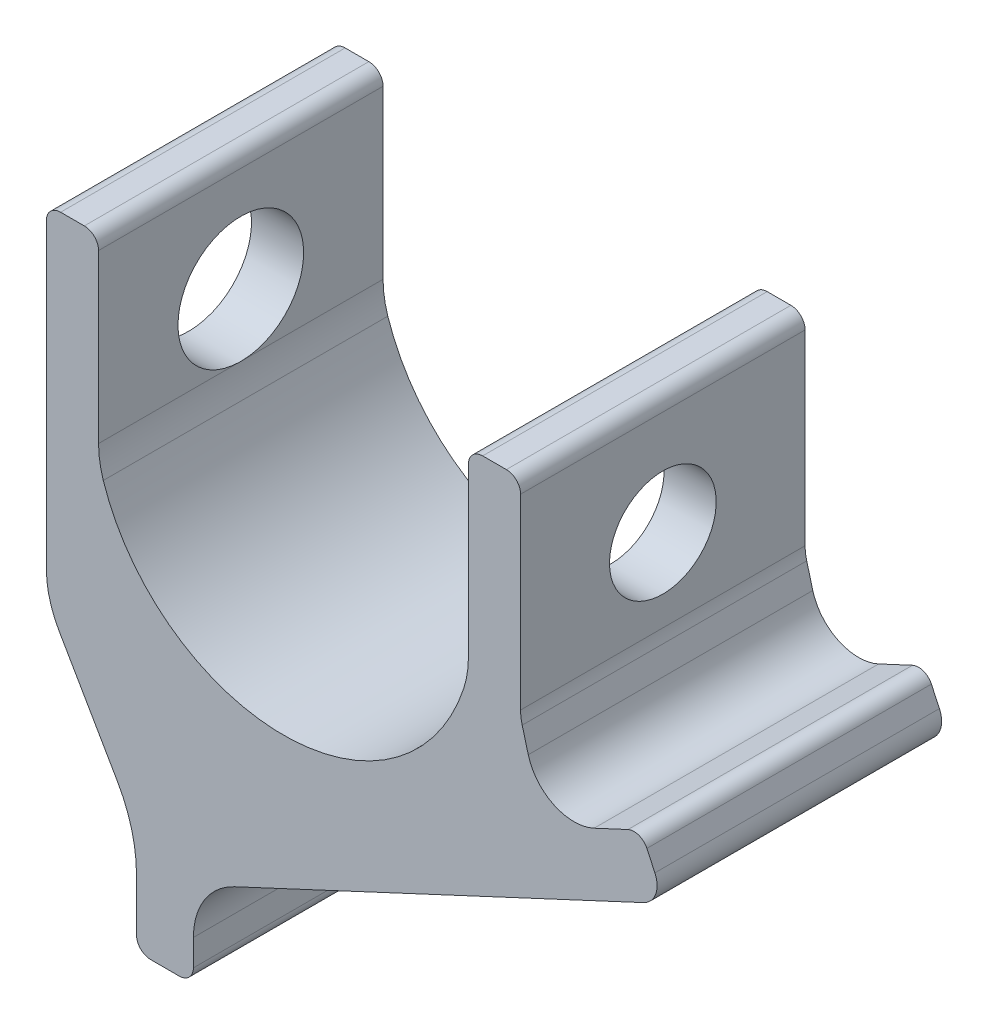
ISO-10303-21;
HEADER;
FILE_DESCRIPTION(('STEP AP214'),'2;1');
FILE_NAME('part.step','',(''),(''),'','','');
FILE_SCHEMA(('AUTOMOTIVE_DESIGN { 1 0 10303 214 1 1 1 1 }'));
ENDSEC;
DATA;
#1=APPLICATION_CONTEXT('core data for automotive mechanical design processes');
#2=APPLICATION_PROTOCOL_DEFINITION('international standard','automotive_design',2000,#1);
#3=PRODUCT_CONTEXT('',#1,'mechanical');
#4=PRODUCT('Part','Part','',(#3));
#5=PRODUCT_RELATED_PRODUCT_CATEGORY('part','',(#4));
#6=PRODUCT_DEFINITION_FORMATION('','',#4);
#7=PRODUCT_DEFINITION_CONTEXT('part definition',#1,'design');
#8=PRODUCT_DEFINITION('design','',#6,#7);
#9=PRODUCT_DEFINITION_SHAPE('','',#8);
#10=(LENGTH_UNIT() NAMED_UNIT(*) SI_UNIT(.MILLI.,.METRE.));
#11=(NAMED_UNIT(*) PLANE_ANGLE_UNIT() SI_UNIT($,.RADIAN.));
#12=(NAMED_UNIT(*) SI_UNIT($,.STERADIAN.) SOLID_ANGLE_UNIT());
#13=UNCERTAINTY_MEASURE_WITH_UNIT(LENGTH_MEASURE(1.E-05),#10,'distance_accuracy_value','');
#14=(GEOMETRIC_REPRESENTATION_CONTEXT(3) GLOBAL_UNCERTAINTY_ASSIGNED_CONTEXT((#13)) GLOBAL_UNIT_ASSIGNED_CONTEXT((#10,
#11,#12)) REPRESENTATION_CONTEXT('',''));
#15=CARTESIAN_POINT('',(0.,0.,0.));
#16=DIRECTION('',(0.,0.,1.));
#17=DIRECTION('',(1.,0.,0.));
#18=AXIS2_PLACEMENT_3D('',#15,#16,#17);
#19=CARTESIAN_POINT('',(-19.,-13.2449979983984,30.));
#20=DIRECTION('',(0.,0.,-1.));
#21=DIRECTION('',(-1.,0.,0.));
#22=AXIS2_PLACEMENT_3D('',#19,#20,#21);
#23=CYLINDRICAL_SURFACE('',#22,20.);
#24=CARTESIAN_POINT('',(-39.,0.,0.));
#25=DIRECTION('',(1.,0.,0.));
#26=DIRECTION('',(0.,-0.999622490445161,0.0274750176745001));
#27=AXIS2_PLACEMENT_3D('',#24,#25,#26);
#28=CIRCLE('',#27,13.25);
#29=CARTESIAN_POINT('',(-39.,-13.2449979983984,0.364043984187208));
#30=VERTEX_POINT('',#29);
#31=CARTESIAN_POINT('',(-39.,-13.2449979983984,-0.364043984187208));
#32=VERTEX_POINT('',#31);
#33=EDGE_CURVE('E56',#30,#32,#28,.T.);
#34=ORIENTED_EDGE('',*,*,#33,.F.);
#35=DIRECTION('',(0.,0.,-1.));
#36=VECTOR('',#35,1.);
#37=CARTESIAN_POINT('',(-39.,-13.2449979983984,30.));
#38=LINE('',#37,#36);
#39=CARTESIAN_POINT('',(-39.,-13.2449979983984,30.));
#40=VERTEX_POINT('',#39);
#41=EDGE_CURVE('E49',#40,#30,#38,.T.);
#42=ORIENTED_EDGE('',*,*,#41,.F.);
#43=CARTESIAN_POINT('',(-19.,-13.2449979983984,30.));
#44=DIRECTION('',(0.,0.,-1.));
#45=DIRECTION('',(-1.,0.,0.));
#46=AXIS2_PLACEMENT_3D('',#43,#44,#45);
#47=CIRCLE('',#46,20.);
#48=CARTESIAN_POINT('',(-38.,-19.4899959967968,30.));
#49=VERTEX_POINT('',#48);
#50=EDGE_CURVE('E254',#49,#40,#47,.T.);
#51=ORIENTED_EDGE('',*,*,#50,.F.);
#52=DIRECTION('',(0.,0.,-1.));
#53=VECTOR('',#52,1.);
#54=CARTESIAN_POINT('',(-38.,-19.4899959967968,30.));
#55=LINE('',#54,#53);
#56=CARTESIAN_POINT('',(-38.,-19.4899959967968,-30.));
#57=VERTEX_POINT('',#56);
#58=EDGE_CURVE('E11',#49,#57,#55,.T.);
#59=ORIENTED_EDGE('',*,*,#58,.T.);
#60=CARTESIAN_POINT('',(-19.,-13.2449979983984,-30.));
#61=DIRECTION('',(0.,0.,-1.));
#62=DIRECTION('',(-1.,0.,0.));
#63=AXIS2_PLACEMENT_3D('',#60,#61,#62);
#64=CIRCLE('',#63,20.);
#65=CARTESIAN_POINT('',(-39.,-13.2449979983984,-30.));
#66=VERTEX_POINT('',#65);
#67=EDGE_CURVE('E360',#57,#66,#64,.T.);
#68=ORIENTED_EDGE('',*,*,#67,.T.);
#69=EDGE_CURVE('E43',#32,#66,#38,.T.);
#70=ORIENTED_EDGE('',*,*,#69,.F.);
#71=EDGE_LOOP('',(#34,#42,#51,#59,#68,#70));
#72=FACE_BOUND('',#71,.T.);
#73=ADVANCED_FACE('F39',(#72),#23,.F.);
#74=CARTESIAN_POINT('',(-39.,-13.2449979983984,30.));
#75=DIRECTION('',(-1.,0.,0.));
#76=DIRECTION('',(0.,0.,1.));
#77=AXIS2_PLACEMENT_3D('',#74,#75,#76);
#78=PLANE('',#77);
#79=CARTESIAN_POINT('',(-39.,0.,0.));
#80=DIRECTION('',(-1.,0.,0.));
#81=DIRECTION('',(0.,0.,1.));
#82=AXIS2_PLACEMENT_3D('',#79,#80,#81);
#83=CIRCLE('',#82,13.25);
#84=EDGE_CURVE('E506',#32,#30,#83,.F.);
#85=ORIENTED_EDGE('',*,*,#84,.F.);
#86=ORIENTED_EDGE('',*,*,#69,.T.);
#87=DIRECTION('',(0.,1.,0.));
#88=VECTOR('',#87,1.);
#89=CARTESIAN_POINT('',(-39.,-13.2449979983984,-30.));
#90=LINE('',#89,#88);
#91=CARTESIAN_POINT('',(-39.,22.,-30.));
#92=VERTEX_POINT('',#91);
#93=EDGE_CURVE('E263',#66,#92,#90,.T.);
#94=ORIENTED_EDGE('',*,*,#93,.T.);
#95=DIRECTION('',(0.,0.,-1.));
#96=VECTOR('',#95,1.);
#97=CARTESIAN_POINT('',(-39.,22.,30.));
#98=LINE('',#97,#96);
#99=CARTESIAN_POINT('',(-39.,22.,30.));
#100=VERTEX_POINT('',#99);
#101=EDGE_CURVE('E260',#100,#92,#98,.T.);
#102=ORIENTED_EDGE('',*,*,#101,.F.);
#103=DIRECTION('',(0.,1.,0.));
#104=VECTOR('',#103,1.);
#105=CARTESIAN_POINT('',(-39.,-13.2449979983984,30.));
#106=LINE('',#105,#104);
#107=EDGE_CURVE('E249',#40,#100,#106,.T.);
#108=ORIENTED_EDGE('',*,*,#107,.F.);
#109=ORIENTED_EDGE('',*,*,#41,.T.);
#110=EDGE_LOOP('',(#85,#86,#94,#102,#108,#109));
#111=FACE_BOUND('',#110,.T.);
#112=ADVANCED_FACE('F261',(#111),#78,.F.);
#113=CARTESIAN_POINT('',(-50.,22.,30.));
#114=DIRECTION('',(1.,0.,0.));
#115=DIRECTION('',(0.,0.,-1.));
#116=AXIS2_PLACEMENT_3D('',#113,#114,#115);
#117=PLANE('',#116);
#118=DIRECTION('',(0.,-1.,0.));
#119=VECTOR('',#118,1.);
#120=CARTESIAN_POINT('',(-50.,22.,-30.));
#121=LINE('',#120,#119);
#122=CARTESIAN_POINT('',(-50.,22.,-30.));
#123=VERTEX_POINT('',#122);
#124=CARTESIAN_POINT('',(-50.,-41.6410161513775,-30.));
#125=VERTEX_POINT('',#124);
#126=EDGE_CURVE('E349',#123,#125,#121,.T.);
#127=ORIENTED_EDGE('',*,*,#126,.T.);
#128=DIRECTION('',(0.,0.,-1.));
#129=VECTOR('',#128,1.);
#130=CARTESIAN_POINT('',(-50.,-41.6410161513775,30.));
#131=LINE('',#130,#129);
#132=CARTESIAN_POINT('',(-50.,-41.6410161513775,30.));
#133=VERTEX_POINT('',#132);
#134=EDGE_CURVE('E584',#133,#125,#131,.T.);
#135=ORIENTED_EDGE('',*,*,#134,.F.);
#136=DIRECTION('',(0.,-1.,0.));
#137=VECTOR('',#136,1.);
#138=CARTESIAN_POINT('',(-50.,22.,30.));
#139=LINE('',#138,#137);
#140=CARTESIAN_POINT('',(-50.,22.,30.));
#141=VERTEX_POINT('',#140);
#142=EDGE_CURVE('E573',#141,#133,#139,.T.);
#143=ORIENTED_EDGE('',*,*,#142,.F.);
#144=DIRECTION('',(0.,0.,-1.));
#145=VECTOR('',#144,1.);
#146=CARTESIAN_POINT('',(-50.,22.,30.));
#147=LINE('',#146,#145);
#148=EDGE_CURVE('E579',#141,#123,#147,.T.);
#149=ORIENTED_EDGE('',*,*,#148,.T.);
#150=EDGE_LOOP('',(#127,#135,#143,#149));
#151=FACE_BOUND('',#150,.T.);
#152=CARTESIAN_POINT('',(-50.,0.,0.));
#153=DIRECTION('',(-1.,0.,0.));
#154=DIRECTION('',(0.,0.,1.));
#155=AXIS2_PLACEMENT_3D('',#152,#153,#154);
#156=CIRCLE('',#155,13.25);
#157=CARTESIAN_POINT('',(-50.,0.,13.25));
#158=VERTEX_POINT('',#157);
#159=EDGE_CURVE('E638',#158,#158,#156,.T.);
#160=ORIENTED_EDGE('',*,*,#159,.F.);
#161=EDGE_LOOP('',(#160));
#162=FACE_BOUND('',#161,.T.);
#163=ADVANCED_FACE('F385',(#151,#162),#117,.F.);
#164=CARTESIAN_POINT('',(50.,22.,30.));
#165=DIRECTION('',(1.,0.,0.));
#166=DIRECTION('',(0.,1.,0.));
#167=AXIS2_PLACEMENT_3D('',#164,#165,#166);
#168=PLANE('',#167);
#169=DIRECTION('',(0.,-1.,0.));
#170=VECTOR('',#169,1.);
#171=CARTESIAN_POINT('',(50.,22.,-30.));
#172=LINE('',#171,#170);
#173=CARTESIAN_POINT('',(50.,22.,-30.));
#174=VERTEX_POINT('',#173);
#175=CARTESIAN_POINT('',(50.,-17.4118095489748,-30.));
#176=VERTEX_POINT('',#175);
#177=EDGE_CURVE('E295',#174,#176,#172,.T.);
#178=ORIENTED_EDGE('',*,*,#177,.F.);
#179=DIRECTION('',(0.,0.,-1.));
#180=VECTOR('',#179,1.);
#181=CARTESIAN_POINT('',(50.,22.,30.));
#182=LINE('',#181,#180);
#183=CARTESIAN_POINT('',(50.,22.,30.));
#184=VERTEX_POINT('',#183);
#185=EDGE_CURVE('E623',#184,#174,#182,.T.);
#186=ORIENTED_EDGE('',*,*,#185,.F.);
#187=DIRECTION('',(0.,-1.,0.));
#188=VECTOR('',#187,1.);
#189=CARTESIAN_POINT('',(50.,22.,30.));
#190=LINE('',#189,#188);
#191=CARTESIAN_POINT('',(50.,-17.4118095489748,30.));
#192=VERTEX_POINT('',#191);
#193=EDGE_CURVE('E521',#184,#192,#190,.T.);
#194=ORIENTED_EDGE('',*,*,#193,.T.);
#195=DIRECTION('',(0.,0.,-1.));
#196=VECTOR('',#195,1.);
#197=CARTESIAN_POINT('',(50.,-17.4118095489748,30.));
#198=LINE('',#197,#196);
#199=EDGE_CURVE('E621',#192,#176,#198,.T.);
#200=ORIENTED_EDGE('',*,*,#199,.T.);
#201=EDGE_LOOP('',(#178,#186,#194,#200));
#202=FACE_BOUND('',#201,.T.);
#203=CARTESIAN_POINT('',(50.,0.,0.));
#204=DIRECTION('',(-1.,0.,0.));
#205=DIRECTION('',(0.,0.,1.));
#206=AXIS2_PLACEMENT_3D('',#203,#204,#205);
#207=CIRCLE('',#206,11.25);
#208=CARTESIAN_POINT('',(50.,0.,11.25));
#209=VERTEX_POINT('',#208);
#210=EDGE_CURVE('E634',#209,#209,#207,.T.);
#211=ORIENTED_EDGE('',*,*,#210,.T.);
#212=EDGE_LOOP('',(#211));
#213=FACE_BOUND('',#212,.T.);
#214=ADVANCED_FACE('F400',(#202,#213),#168,.T.);
#215=CARTESIAN_POINT('',(39.,-13.2449979983984,30.));
#216=DIRECTION('',(-1.,0.,0.));
#217=DIRECTION('',(0.,-1.,0.));
#218=AXIS2_PLACEMENT_3D('',#215,#216,#217);
#219=PLANE('',#218);
#220=DIRECTION('',(0.,1.,0.));
#221=VECTOR('',#220,1.);
#222=CARTESIAN_POINT('',(39.,-13.2449979983984,-30.));
#223=LINE('',#222,#221);
#224=CARTESIAN_POINT('',(39.,-13.2449979983984,-30.));
#225=VERTEX_POINT('',#224);
#226=CARTESIAN_POINT('',(39.,22.,-30.));
#227=VERTEX_POINT('',#226);
#228=EDGE_CURVE('E283',#225,#227,#223,.T.);
#229=ORIENTED_EDGE('',*,*,#228,.F.);
#230=DIRECTION('',(0.,0.,-1.));
#231=VECTOR('',#230,1.);
#232=CARTESIAN_POINT('',(39.,-13.2449979983984,30.));
#233=LINE('',#232,#231);
#234=CARTESIAN_POINT('',(39.,-13.2449979983984,30.));
#235=VERTEX_POINT('',#234);
#236=EDGE_CURVE('E495',#235,#225,#233,.T.);
#237=ORIENTED_EDGE('',*,*,#236,.F.);
#238=DIRECTION('',(0.,1.,0.));
#239=VECTOR('',#238,1.);
#240=CARTESIAN_POINT('',(39.,-13.2449979983984,30.));
#241=LINE('',#240,#239);
#242=CARTESIAN_POINT('',(39.,22.,30.));
#243=VERTEX_POINT('',#242);
#244=EDGE_CURVE('E503',#235,#243,#241,.T.);
#245=ORIENTED_EDGE('',*,*,#244,.T.);
#246=DIRECTION('',(0.,0.,-1.));
#247=VECTOR('',#246,1.);
#248=CARTESIAN_POINT('',(39.,22.,30.));
#249=LINE('',#248,#247);
#250=EDGE_CURVE('E629',#243,#227,#249,.T.);
#251=ORIENTED_EDGE('',*,*,#250,.T.);
#252=EDGE_LOOP('',(#229,#237,#245,#251));
#253=FACE_BOUND('',#252,.T.);
#254=CARTESIAN_POINT('',(39.,0.,0.));
#255=DIRECTION('',(-1.,0.,0.));
#256=DIRECTION('',(0.,-1.,0.));
#257=AXIS2_PLACEMENT_3D('',#254,#255,#256);
#258=CIRCLE('',#257,11.25);
#259=CARTESIAN_POINT('',(39.,-11.25,0.));
#260=VERTEX_POINT('',#259);
#261=EDGE_CURVE('E632',#260,#260,#258,.F.);
#262=ORIENTED_EDGE('',*,*,#261,.T.);
#263=EDGE_LOOP('',(#262));
#264=FACE_BOUND('',#263,.T.);
#265=ADVANCED_FACE('F389',(#253,#264),#219,.T.);
#266=CARTESIAN_POINT('',(-42.,22.,30.));
#267=DIRECTION('',(0.,0.,-1.));
#268=DIRECTION('',(-1.,0.,0.));
#269=AXIS2_PLACEMENT_3D('',#266,#267,#268);
#270=CYLINDRICAL_SURFACE('',#269,3.);
#271=CARTESIAN_POINT('',(-42.,22.,-30.));
#272=DIRECTION('',(0.,0.,-1.));
#273=DIRECTION('',(-1.,0.,0.));
#274=AXIS2_PLACEMENT_3D('',#271,#272,#273);
#275=CIRCLE('',#274,3.);
#276=CARTESIAN_POINT('',(-42.,25.,-30.));
#277=VERTEX_POINT('',#276);
#278=EDGE_CURVE('E357',#277,#92,#275,.T.);
#279=ORIENTED_EDGE('',*,*,#278,.F.);
#280=DIRECTION('',(0.,0.,-1.));
#281=VECTOR('',#280,1.);
#282=CARTESIAN_POINT('',(-42.,25.,30.));
#283=LINE('',#282,#281);
#284=CARTESIAN_POINT('',(-42.,25.,30.));
#285=VERTEX_POINT('',#284);
#286=EDGE_CURVE('E267',#285,#277,#283,.T.);
#287=ORIENTED_EDGE('',*,*,#286,.F.);
#288=CARTESIAN_POINT('',(-42.,22.,30.));
#289=DIRECTION('',(0.,0.,-1.));
#290=DIRECTION('',(-1.,0.,0.));
#291=AXIS2_PLACEMENT_3D('',#288,#289,#290);
#292=CIRCLE('',#291,3.);
#293=EDGE_CURVE('E253',#285,#100,#292,.T.);
#294=ORIENTED_EDGE('',*,*,#293,.T.);
#295=ORIENTED_EDGE('',*,*,#101,.T.);
#296=EDGE_LOOP('',(#279,#287,#294,#295));
#297=FACE_BOUND('',#296,.T.);
#298=ADVANCED_FACE('F269',(#297),#270,.T.);
#299=CARTESIAN_POINT('',(-42.,25.,30.));
#300=DIRECTION('',(0.,-1.,0.));
#301=DIRECTION('',(0.,0.,-1.));
#302=AXIS2_PLACEMENT_3D('',#299,#300,#301);
#303=PLANE('',#302);
#304=DIRECTION('',(-1.,0.,0.));
#305=VECTOR('',#304,1.);
#306=CARTESIAN_POINT('',(-42.,25.,-30.));
#307=LINE('',#306,#305);
#308=CARTESIAN_POINT('',(-47.,25.,-30.));
#309=VERTEX_POINT('',#308);
#310=EDGE_CURVE('E354',#277,#309,#307,.T.);
#311=ORIENTED_EDGE('',*,*,#310,.T.);
#312=DIRECTION('',(0.,0.,-1.));
#313=VECTOR('',#312,1.);
#314=CARTESIAN_POINT('',(-47.,25.,30.));
#315=LINE('',#314,#313);
#316=CARTESIAN_POINT('',(-47.,25.,30.));
#317=VERTEX_POINT('',#316);
#318=EDGE_CURVE('E578',#317,#309,#315,.T.);
#319=ORIENTED_EDGE('',*,*,#318,.F.);
#320=DIRECTION('',(-1.,0.,0.));
#321=VECTOR('',#320,1.);
#322=CARTESIAN_POINT('',(-42.,25.,30.));
#323=LINE('',#322,#321);
#324=EDGE_CURVE('E271',#285,#317,#323,.T.);
#325=ORIENTED_EDGE('',*,*,#324,.F.);
#326=ORIENTED_EDGE('',*,*,#286,.T.);
#327=EDGE_LOOP('',(#311,#319,#325,#326));
#328=FACE_BOUND('',#327,.T.);
#329=ADVANCED_FACE('F388',(#328),#303,.F.);
#330=CARTESIAN_POINT('',(-47.,22.,30.));
#331=DIRECTION('',(0.,0.,-1.));
#332=DIRECTION('',(-1.,0.,0.));
#333=AXIS2_PLACEMENT_3D('',#330,#331,#332);
#334=CYLINDRICAL_SURFACE('',#333,3.);
#335=CARTESIAN_POINT('',(-47.,22.,-30.));
#336=DIRECTION('',(0.,0.,-1.));
#337=DIRECTION('',(-1.,0.,0.));
#338=AXIS2_PLACEMENT_3D('',#335,#336,#337);
#339=CIRCLE('',#338,3.);
#340=EDGE_CURVE('E351',#123,#309,#339,.T.);
#341=ORIENTED_EDGE('',*,*,#340,.F.);
#342=ORIENTED_EDGE('',*,*,#148,.F.);
#343=CARTESIAN_POINT('',(-47.,22.,30.));
#344=DIRECTION('',(0.,0.,-1.));
#345=DIRECTION('',(-1.,0.,0.));
#346=AXIS2_PLACEMENT_3D('',#343,#344,#345);
#347=CIRCLE('',#346,3.);
#348=EDGE_CURVE('E273',#141,#317,#347,.T.);
#349=ORIENTED_EDGE('',*,*,#348,.T.);
#350=ORIENTED_EDGE('',*,*,#318,.T.);
#351=EDGE_LOOP('',(#341,#342,#349,#350));
#352=FACE_BOUND('',#351,.T.);
#353=ADVANCED_FACE('F392',(#352),#334,.T.);
#354=CARTESIAN_POINT('',(-30.,-41.6410161513775,30.));
#355=DIRECTION('',(0.,0.,-1.));
#356=DIRECTION('',(-1.,0.,0.));
#357=AXIS2_PLACEMENT_3D('',#354,#355,#356);
#358=CYLINDRICAL_SURFACE('',#357,20.);
#359=CARTESIAN_POINT('',(-30.,-41.6410161513775,-30.));
#360=DIRECTION('',(0.,0.,1.));
#361=DIRECTION('',(1.,0.,0.));
#362=AXIS2_PLACEMENT_3D('',#359,#360,#361);
#363=CIRCLE('',#362,20.);
#364=CARTESIAN_POINT('',(-47.3205080756888,-51.6410161513775,-30.));
#365=VERTEX_POINT('',#364);
#366=EDGE_CURVE('E346',#125,#365,#363,.T.);
#367=ORIENTED_EDGE('',*,*,#366,.T.);
#368=DIRECTION('',(0.,0.,-1.));
#369=VECTOR('',#368,1.);
#370=CARTESIAN_POINT('',(-47.3205080756888,-51.6410161513775,30.));
#371=LINE('',#370,#369);
#372=CARTESIAN_POINT('',(-47.3205080756888,-51.6410161513775,30.));
#373=VERTEX_POINT('',#372);
#374=EDGE_CURVE('E589',#373,#365,#371,.T.);
#375=ORIENTED_EDGE('',*,*,#374,.F.);
#376=CARTESIAN_POINT('',(-30.,-41.6410161513775,30.));
#377=DIRECTION('',(0.,0.,1.));
#378=DIRECTION('',(1.,0.,0.));
#379=AXIS2_PLACEMENT_3D('',#376,#377,#378);
#380=CIRCLE('',#379,20.);
#381=EDGE_CURVE('E571',#133,#373,#380,.T.);
#382=ORIENTED_EDGE('',*,*,#381,.F.);
#383=ORIENTED_EDGE('',*,*,#134,.T.);
#384=EDGE_LOOP('',(#367,#375,#382,#383));
#385=FACE_BOUND('',#384,.T.);
#386=ADVANCED_FACE('F396',(#385),#358,.T.);
#387=CARTESIAN_POINT('',(-35.0192378864668,-72.9474411167423,30.));
#388=DIRECTION('',(-0.866025403784438,-0.5,0.));
#389=DIRECTION('',(0.5,-0.866025403784438,0.));
#390=AXIS2_PLACEMENT_3D('',#387,#388,#389);
#391=PLANE('',#390);
#392=DIRECTION('',(-0.5,0.866025403784438,0.));
#393=VECTOR('',#392,1.);
#394=CARTESIAN_POINT('',(-35.0192378864668,-72.9474411167423,-30.));
#395=LINE('',#394,#393);
#396=CARTESIAN_POINT('',(-35.0192378864668,-72.9474411167423,-30.));
#397=VERTEX_POINT('',#396);
#398=EDGE_CURVE('E343',#397,#365,#395,.T.);
#399=ORIENTED_EDGE('',*,*,#398,.F.);
#400=DIRECTION('',(0.,0.,-1.));
#401=VECTOR('',#400,1.);
#402=CARTESIAN_POINT('',(-35.0192378864668,-72.9474411167423,30.));
#403=LINE('',#402,#401);
#404=CARTESIAN_POINT('',(-35.0192378864668,-72.9474411167423,30.));
#405=VERTEX_POINT('',#404);
#406=EDGE_CURVE('E591',#405,#397,#403,.T.);
#407=ORIENTED_EDGE('',*,*,#406,.F.);
#408=DIRECTION('',(-0.5,0.866025403784438,0.));
#409=VECTOR('',#408,1.);
#410=CARTESIAN_POINT('',(-35.0192378864668,-72.9474411167423,30.));
#411=LINE('',#410,#409);
#412=EDGE_CURVE('E568',#405,#373,#411,.T.);
#413=ORIENTED_EDGE('',*,*,#412,.T.);
#414=ORIENTED_EDGE('',*,*,#374,.T.);
#415=EDGE_LOOP('',(#399,#407,#413,#414));
#416=FACE_BOUND('',#415,.T.);
#417=ADVANCED_FACE('F404',(#416),#391,.T.);
#418=CARTESIAN_POINT('',(-61.,-87.9474411167423,30.));
#419=DIRECTION('',(0.,0.,-1.));
#420=DIRECTION('',(-1.,0.,0.));
#421=AXIS2_PLACEMENT_3D('',#418,#419,#420);
#422=CYLINDRICAL_SURFACE('',#421,30.);
#423=CARTESIAN_POINT('',(-61.,-87.9474411167423,-30.));
#424=DIRECTION('',(0.,0.,1.));
#425=DIRECTION('',(1.,0.,0.));
#426=AXIS2_PLACEMENT_3D('',#423,#424,#425);
#427=CIRCLE('',#426,30.);
#428=CARTESIAN_POINT('',(-31.,-87.9474411167423,-30.));
#429=VERTEX_POINT('',#428);
#430=EDGE_CURVE('E340',#429,#397,#427,.T.);
#431=ORIENTED_EDGE('',*,*,#430,.F.);
#432=DIRECTION('',(0.,0.,-1.));
#433=VECTOR('',#432,1.);
#434=CARTESIAN_POINT('',(-31.,-87.9474411167423,30.));
#435=LINE('',#434,#433);
#436=CARTESIAN_POINT('',(-31.,-87.9474411167423,30.));
#437=VERTEX_POINT('',#436);
#438=EDGE_CURVE('E593',#437,#429,#435,.T.);
#439=ORIENTED_EDGE('',*,*,#438,.F.);
#440=CARTESIAN_POINT('',(-61.,-87.9474411167423,30.));
#441=DIRECTION('',(0.,0.,1.));
#442=DIRECTION('',(1.,0.,0.));
#443=AXIS2_PLACEMENT_3D('',#440,#441,#442);
#444=CIRCLE('',#443,30.);
#445=EDGE_CURVE('E565',#437,#405,#444,.T.);
#446=ORIENTED_EDGE('',*,*,#445,.T.);
#447=ORIENTED_EDGE('',*,*,#406,.T.);
#448=EDGE_LOOP('',(#431,#439,#446,#447));
#449=FACE_BOUND('',#448,.T.);
#450=ADVANCED_FACE('F408',(#449),#422,.F.);
#451=CARTESIAN_POINT('',(-31.,-99.,30.));
#452=DIRECTION('',(-1.,0.,0.));
#453=DIRECTION('',(0.,-1.,0.));
#454=AXIS2_PLACEMENT_3D('',#451,#452,#453);
#455=PLANE('',#454);
#456=DIRECTION('',(0.,1.,0.));
#457=VECTOR('',#456,1.);
#458=CARTESIAN_POINT('',(-31.,-99.,-30.));
#459=LINE('',#458,#457);
#460=CARTESIAN_POINT('',(-31.,-99.,-30.));
#461=VERTEX_POINT('',#460);
#462=EDGE_CURVE('E337',#461,#429,#459,.T.);
#463=ORIENTED_EDGE('',*,*,#462,.F.);
#464=DIRECTION('',(0.,0.,-1.));
#465=VECTOR('',#464,1.);
#466=CARTESIAN_POINT('',(-31.,-99.,30.));
#467=LINE('',#466,#465);
#468=CARTESIAN_POINT('',(-31.,-99.,30.));
#469=VERTEX_POINT('',#468);
#470=EDGE_CURVE('E595',#469,#461,#467,.T.);
#471=ORIENTED_EDGE('',*,*,#470,.F.);
#472=DIRECTION('',(0.,1.,0.));
#473=VECTOR('',#472,1.);
#474=CARTESIAN_POINT('',(-31.,-99.,30.));
#475=LINE('',#474,#473);
#476=EDGE_CURVE('E562',#469,#437,#475,.T.);
#477=ORIENTED_EDGE('',*,*,#476,.T.);
#478=ORIENTED_EDGE('',*,*,#438,.T.);
#479=EDGE_LOOP('',(#463,#471,#477,#478));
#480=FACE_BOUND('',#479,.T.);
#481=ADVANCED_FACE('F412',(#480),#455,.T.);
#482=CARTESIAN_POINT('',(-28.,-99.,30.));
#483=DIRECTION('',(0.,0.,-1.));
#484=DIRECTION('',(-1.,0.,0.));
#485=AXIS2_PLACEMENT_3D('',#482,#483,#484);
#486=CYLINDRICAL_SURFACE('',#485,3.);
#487=CARTESIAN_POINT('',(-28.,-99.,-30.));
#488=DIRECTION('',(0.,0.,-1.));
#489=DIRECTION('',(-1.,0.,0.));
#490=AXIS2_PLACEMENT_3D('',#487,#488,#489);
#491=CIRCLE('',#490,3.);
#492=CARTESIAN_POINT('',(-28.,-102.,-30.));
#493=VERTEX_POINT('',#492);
#494=EDGE_CURVE('E334',#493,#461,#491,.T.);
#495=ORIENTED_EDGE('',*,*,#494,.F.);
#496=DIRECTION('',(0.,0.,-1.));
#497=VECTOR('',#496,1.);
#498=CARTESIAN_POINT('',(-28.,-102.,30.));
#499=LINE('',#498,#497);
#500=CARTESIAN_POINT('',(-28.,-102.,30.));
#501=VERTEX_POINT('',#500);
#502=EDGE_CURVE('E597',#501,#493,#499,.T.);
#503=ORIENTED_EDGE('',*,*,#502,.F.);
#504=CARTESIAN_POINT('',(-28.,-99.,30.));
#505=DIRECTION('',(0.,0.,-1.));
#506=DIRECTION('',(-1.,0.,0.));
#507=AXIS2_PLACEMENT_3D('',#504,#505,#506);
#508=CIRCLE('',#507,3.);
#509=EDGE_CURVE('E559',#501,#469,#508,.T.);
#510=ORIENTED_EDGE('',*,*,#509,.T.);
#511=ORIENTED_EDGE('',*,*,#470,.T.);
#512=EDGE_LOOP('',(#495,#503,#510,#511));
#513=FACE_BOUND('',#512,.T.);
#514=ADVANCED_FACE('F416',(#513),#486,.T.);
#515=CARTESIAN_POINT('',(-22.,-102.,30.));
#516=DIRECTION('',(0.,-1.,0.));
#517=DIRECTION('',(0.,0.,-1.));
#518=AXIS2_PLACEMENT_3D('',#515,#516,#517);
#519=PLANE('',#518);
#520=DIRECTION('',(-1.,0.,0.));
#521=VECTOR('',#520,1.);
#522=CARTESIAN_POINT('',(-22.,-102.,-30.));
#523=LINE('',#522,#521);
#524=CARTESIAN_POINT('',(-22.,-102.,-30.));
#525=VERTEX_POINT('',#524);
#526=EDGE_CURVE('E331',#525,#493,#523,.T.);
#527=ORIENTED_EDGE('',*,*,#526,.F.);
#528=DIRECTION('',(0.,0.,-1.));
#529=VECTOR('',#528,1.);
#530=CARTESIAN_POINT('',(-22.,-102.,30.));
#531=LINE('',#530,#529);
#532=CARTESIAN_POINT('',(-22.,-102.,30.));
#533=VERTEX_POINT('',#532);
#534=EDGE_CURVE('E599',#533,#525,#531,.T.);
#535=ORIENTED_EDGE('',*,*,#534,.F.);
#536=DIRECTION('',(-1.,0.,0.));
#537=VECTOR('',#536,1.);
#538=CARTESIAN_POINT('',(-22.,-102.,30.));
#539=LINE('',#538,#537);
#540=EDGE_CURVE('E556',#533,#501,#539,.T.);
#541=ORIENTED_EDGE('',*,*,#540,.T.);
#542=ORIENTED_EDGE('',*,*,#502,.T.);
#543=EDGE_LOOP('',(#527,#535,#541,#542));
#544=FACE_BOUND('',#543,.T.);
#545=ADVANCED_FACE('F420',(#544),#519,.T.);
#546=CARTESIAN_POINT('',(-22.,-99.,30.));
#547=DIRECTION('',(0.,0.,-1.));
#548=DIRECTION('',(-1.,0.,0.));
#549=AXIS2_PLACEMENT_3D('',#546,#547,#548);
#550=CYLINDRICAL_SURFACE('',#549,3.);
#551=CARTESIAN_POINT('',(-22.,-99.,-30.));
#552=DIRECTION('',(0.,0.,-1.));
#553=DIRECTION('',(-1.,0.,0.));
#554=AXIS2_PLACEMENT_3D('',#551,#552,#553);
#555=CIRCLE('',#554,3.);
#556=CARTESIAN_POINT('',(-19.,-99.,-30.));
#557=VERTEX_POINT('',#556);
#558=EDGE_CURVE('E328',#557,#525,#555,.T.);
#559=ORIENTED_EDGE('',*,*,#558,.F.);
#560=DIRECTION('',(0.,0.,-1.));
#561=VECTOR('',#560,1.);
#562=CARTESIAN_POINT('',(-19.,-99.,30.));
#563=LINE('',#562,#561);
#564=CARTESIAN_POINT('',(-19.,-99.,30.));
#565=VERTEX_POINT('',#564);
#566=EDGE_CURVE('E601',#565,#557,#563,.T.);
#567=ORIENTED_EDGE('',*,*,#566,.F.);
#568=CARTESIAN_POINT('',(-22.,-99.,30.));
#569=DIRECTION('',(0.,0.,-1.));
#570=DIRECTION('',(-1.,0.,0.));
#571=AXIS2_PLACEMENT_3D('',#568,#569,#570);
#572=CIRCLE('',#571,3.);
#573=EDGE_CURVE('E553',#565,#533,#572,.T.);
#574=ORIENTED_EDGE('',*,*,#573,.T.);
#575=ORIENTED_EDGE('',*,*,#534,.T.);
#576=EDGE_LOOP('',(#559,#567,#574,#575));
#577=FACE_BOUND('',#576,.T.);
#578=ADVANCED_FACE('F424',(#577),#550,.T.);
#579=CARTESIAN_POINT('',(-19.,-93.4455979065066,30.));
#580=DIRECTION('',(1.,0.,0.));
#581=DIRECTION('',(0.,0.,-1.));
#582=AXIS2_PLACEMENT_3D('',#579,#580,#581);
#583=PLANE('',#582);
#584=DIRECTION('',(0.,-1.,0.));
#585=VECTOR('',#584,1.);
#586=CARTESIAN_POINT('',(-19.,-93.4455979065066,-30.));
#587=LINE('',#586,#585);
#588=CARTESIAN_POINT('',(-19.,-93.4455979065066,-30.));
#589=VERTEX_POINT('',#588);
#590=EDGE_CURVE('E325',#589,#557,#587,.T.);
#591=ORIENTED_EDGE('',*,*,#590,.F.);
#592=DIRECTION('',(0.,0.,-1.));
#593=VECTOR('',#592,1.);
#594=CARTESIAN_POINT('',(-19.,-93.4455979065066,30.));
#595=LINE('',#594,#593);
#596=CARTESIAN_POINT('',(-19.,-93.4455979065066,30.));
#597=VERTEX_POINT('',#596);
#598=EDGE_CURVE('E603',#597,#589,#595,.T.);
#599=ORIENTED_EDGE('',*,*,#598,.F.);
#600=DIRECTION('',(0.,-1.,0.));
#601=VECTOR('',#600,1.);
#602=CARTESIAN_POINT('',(-19.,-93.4455979065066,30.));
#603=LINE('',#602,#601);
#604=EDGE_CURVE('E550',#597,#565,#603,.T.);
#605=ORIENTED_EDGE('',*,*,#604,.T.);
#606=ORIENTED_EDGE('',*,*,#566,.T.);
#607=EDGE_LOOP('',(#591,#599,#605,#606));
#608=FACE_BOUND('',#607,.T.);
#609=ADVANCED_FACE('F428',(#608),#583,.T.);
#610=CARTESIAN_POINT('',(-3.99999999999999,-93.4455979065066,30.));
#611=DIRECTION('',(0.,0.,-1.));
#612=DIRECTION('',(-1.,0.,0.));
#613=AXIS2_PLACEMENT_3D('',#610,#611,#612);
#614=CYLINDRICAL_SURFACE('',#613,15.);
#615=CARTESIAN_POINT('',(-3.99999999999999,-93.4455979065066,-30.));
#616=DIRECTION('',(0.,0.,-1.));
#617=DIRECTION('',(-1.,0.,0.));
#618=AXIS2_PLACEMENT_3D('',#615,#616,#617);
#619=CIRCLE('',#618,15.);
#620=CARTESIAN_POINT('',(-10.3392739261104,-79.8509811009568,-30.));
#621=VERTEX_POINT('',#620);
#622=EDGE_CURVE('E322',#589,#621,#619,.T.);
#623=ORIENTED_EDGE('',*,*,#622,.T.);
#624=DIRECTION('',(0.,0.,-1.));
#625=VECTOR('',#624,1.);
#626=CARTESIAN_POINT('',(-10.3392739261104,-79.8509811009568,30.));
#627=LINE('',#626,#625);
#628=CARTESIAN_POINT('',(-10.3392739261104,-79.8509811009568,30.));
#629=VERTEX_POINT('',#628);
#630=EDGE_CURVE('E605',#629,#621,#627,.T.);
#631=ORIENTED_EDGE('',*,*,#630,.F.);
#632=CARTESIAN_POINT('',(-3.99999999999999,-93.4455979065066,30.));
#633=DIRECTION('',(0.,0.,-1.));
#634=DIRECTION('',(-1.,0.,0.));
#635=AXIS2_PLACEMENT_3D('',#632,#633,#634);
#636=CIRCLE('',#635,15.);
#637=EDGE_CURVE('E548',#597,#629,#636,.T.);
#638=ORIENTED_EDGE('',*,*,#637,.F.);
#639=ORIENTED_EDGE('',*,*,#598,.T.);
#640=EDGE_LOOP('',(#623,#631,#638,#639));
#641=FACE_BOUND('',#640,.T.);
#642=ADVANCED_FACE('F432',(#641),#614,.F.);
#643=CARTESIAN_POINT('',(75.9038145344666,-39.6351684888513,30.));
#644=DIRECTION('',(0.422618261740695,-0.906307787036652,0.));
#645=DIRECTION('',(0.906307787036652,0.422618261740695,0.));
#646=AXIS2_PLACEMENT_3D('',#643,#644,#645);
#647=PLANE('',#646);
#648=DIRECTION('',(-0.906307787036652,-0.422618261740695,0.));
#649=VECTOR('',#648,1.);
#650=CARTESIAN_POINT('',(75.9038145344666,-39.6351684888513,-30.));
#651=LINE('',#650,#649);
#652=CARTESIAN_POINT('',(75.9038145344666,-39.6351684888513,-30.));
#653=VERTEX_POINT('',#652);
#654=EDGE_CURVE('E319',#653,#621,#651,.T.);
#655=ORIENTED_EDGE('',*,*,#654,.F.);
#656=DIRECTION('',(0.,0.,-1.));
#657=VECTOR('',#656,1.);
#658=CARTESIAN_POINT('',(75.9038145344666,-39.6351684888513,30.));
#659=LINE('',#658,#657);
#660=CARTESIAN_POINT('',(75.9038145344666,-39.6351684888513,30.));
#661=VERTEX_POINT('',#660);
#662=EDGE_CURVE('E607',#661,#653,#659,.T.);
#663=ORIENTED_EDGE('',*,*,#662,.F.);
#664=DIRECTION('',(-0.906307787036652,-0.422618261740695,0.));
#665=VECTOR('',#664,1.);
#666=CARTESIAN_POINT('',(75.9038145344666,-39.6351684888513,30.));
#667=LINE('',#666,#665);
#668=EDGE_CURVE('E545',#661,#629,#667,.T.);
#669=ORIENTED_EDGE('',*,*,#668,.T.);
#670=ORIENTED_EDGE('',*,*,#630,.T.);
#671=EDGE_LOOP('',(#655,#663,#669,#670));
#672=FACE_BOUND('',#671,.T.);
#673=ADVANCED_FACE('F436',(#672),#647,.T.);
#674=CARTESIAN_POINT('',(73.7907232257631,-35.103629553668,30.));
#675=DIRECTION('',(0.,0.,-1.));
#676=DIRECTION('',(-1.,0.,0.));
#677=AXIS2_PLACEMENT_3D('',#674,#675,#676);
#678=CYLINDRICAL_SURFACE('',#677,5.00000000000001);
#679=CARTESIAN_POINT('',(73.7907232257631,-35.103629553668,-30.));
#680=DIRECTION('',(0.,0.,-1.));
#681=DIRECTION('',(-1.,0.,0.));
#682=AXIS2_PLACEMENT_3D('',#679,#680,#681);
#683=CIRCLE('',#682,5.00000000000001);
#684=CARTESIAN_POINT('',(78.3222621609464,-32.9905382449645,-30.));
#685=VERTEX_POINT('',#684);
#686=EDGE_CURVE('E316',#685,#653,#683,.T.);
#687=ORIENTED_EDGE('',*,*,#686,.F.);
#688=DIRECTION('',(0.,0.,-1.));
#689=VECTOR('',#688,1.);
#690=CARTESIAN_POINT('',(78.3222621609464,-32.9905382449645,30.));
#691=LINE('',#690,#689);
#692=CARTESIAN_POINT('',(78.3222621609464,-32.9905382449645,30.));
#693=VERTEX_POINT('',#692);
#694=EDGE_CURVE('E609',#693,#685,#691,.T.);
#695=ORIENTED_EDGE('',*,*,#694,.F.);
#696=CARTESIAN_POINT('',(73.7907232257631,-35.103629553668,30.));
#697=DIRECTION('',(0.,0.,-1.));
#698=DIRECTION('',(-1.,0.,0.));
#699=AXIS2_PLACEMENT_3D('',#696,#697,#698);
#700=CIRCLE('',#699,5.00000000000001);
#701=EDGE_CURVE('E542',#693,#661,#700,.T.);
#702=ORIENTED_EDGE('',*,*,#701,.T.);
#703=ORIENTED_EDGE('',*,*,#662,.T.);
#704=EDGE_LOOP('',(#687,#695,#702,#703));
#705=FACE_BOUND('',#704,.T.);
#706=ADVANCED_FACE('F440',(#705),#678,.T.);
#707=CARTESIAN_POINT('',(76.6317891139836,-29.3653070968179,30.));
#708=DIRECTION('',(0.906307787036652,0.422618261740694,0.));
#709=DIRECTION('',(-0.422618261740694,0.906307787036652,0.));
#710=AXIS2_PLACEMENT_3D('',#707,#708,#709);
#711=PLANE('',#710);
#712=DIRECTION('',(0.422618261740694,-0.906307787036652,0.));
#713=VECTOR('',#712,1.);
#714=CARTESIAN_POINT('',(76.6317891139836,-29.3653070968179,-30.));
#715=LINE('',#714,#713);
#716=CARTESIAN_POINT('',(76.6317891139836,-29.3653070968179,-30.));
#717=VERTEX_POINT('',#716);
#718=EDGE_CURVE('E313',#717,#685,#715,.T.);
#719=ORIENTED_EDGE('',*,*,#718,.F.);
#720=DIRECTION('',(0.,0.,-1.));
#721=VECTOR('',#720,1.);
#722=CARTESIAN_POINT('',(76.6317891139836,-29.3653070968179,30.));
#723=LINE('',#722,#721);
#724=CARTESIAN_POINT('',(76.6317891139836,-29.3653070968179,30.));
#725=VERTEX_POINT('',#724);
#726=EDGE_CURVE('E611',#725,#717,#723,.T.);
#727=ORIENTED_EDGE('',*,*,#726,.F.);
#728=DIRECTION('',(0.422618261740694,-0.906307787036652,0.));
#729=VECTOR('',#728,1.);
#730=CARTESIAN_POINT('',(76.6317891139836,-29.3653070968179,30.));
#731=LINE('',#730,#729);
#732=EDGE_CURVE('E539',#725,#693,#731,.T.);
#733=ORIENTED_EDGE('',*,*,#732,.T.);
#734=ORIENTED_EDGE('',*,*,#694,.T.);
#735=EDGE_LOOP('',(#719,#727,#733,#734));
#736=FACE_BOUND('',#735,.T.);
#737=ADVANCED_FACE('F444',(#736),#711,.T.);
#738=CARTESIAN_POINT('',(73.9128657528737,-30.63316188204,30.));
#739=DIRECTION('',(0.,0.,-1.));
#740=DIRECTION('',(-1.,0.,0.));
#741=AXIS2_PLACEMENT_3D('',#738,#739,#740);
#742=CYLINDRICAL_SURFACE('',#741,2.99999999999999);
#743=CARTESIAN_POINT('',(73.9128657528737,-30.63316188204,-30.));
#744=DIRECTION('',(0.,0.,-1.));
#745=DIRECTION('',(-1.,0.,0.));
#746=AXIS2_PLACEMENT_3D('',#743,#744,#745);
#747=CIRCLE('',#746,2.99999999999999);
#748=CARTESIAN_POINT('',(72.6450109676516,-27.9142385209301,-30.));
#749=VERTEX_POINT('',#748);
#750=EDGE_CURVE('E310',#749,#717,#747,.T.);
#751=ORIENTED_EDGE('',*,*,#750,.F.);
#752=DIRECTION('',(0.,0.,-1.));
#753=VECTOR('',#752,1.);
#754=CARTESIAN_POINT('',(72.6450109676516,-27.9142385209301,30.));
#755=LINE('',#754,#753);
#756=CARTESIAN_POINT('',(72.6450109676516,-27.9142385209301,30.));
#757=VERTEX_POINT('',#756);
#758=EDGE_CURVE('E613',#757,#749,#755,.T.);
#759=ORIENTED_EDGE('',*,*,#758,.F.);
#760=CARTESIAN_POINT('',(73.9128657528737,-30.63316188204,30.));
#761=DIRECTION('',(0.,0.,-1.));
#762=DIRECTION('',(-1.,0.,0.));
#763=AXIS2_PLACEMENT_3D('',#760,#761,#762);
#764=CIRCLE('',#763,2.99999999999999);
#765=EDGE_CURVE('E536',#757,#725,#764,.T.);
#766=ORIENTED_EDGE('',*,*,#765,.T.);
#767=ORIENTED_EDGE('',*,*,#726,.T.);
#768=EDGE_LOOP('',(#751,#759,#766,#767));
#769=FACE_BOUND('',#768,.T.);
#770=ADVANCED_FACE('F448',(#769),#742,.T.);
#771=CARTESIAN_POINT('',(65.5040904658677,-31.2441044371879,30.));
#772=DIRECTION('',(-0.422618261740694,0.906307787036652,0.));
#773=DIRECTION('',(-0.906307787036652,-0.422618261740694,0.));
#774=AXIS2_PLACEMENT_3D('',#771,#772,#773);
#775=PLANE('',#774);
#776=DIRECTION('',(0.906307787036652,0.422618261740694,0.));
#777=VECTOR('',#776,1.);
#778=CARTESIAN_POINT('',(65.5040904658677,-31.2441044371879,-30.));
#779=LINE('',#778,#777);
#780=CARTESIAN_POINT('',(65.5040904658677,-31.2441044371879,-30.));
#781=VERTEX_POINT('',#780);
#782=EDGE_CURVE('E307',#781,#749,#779,.T.);
#783=ORIENTED_EDGE('',*,*,#782,.F.);
#784=DIRECTION('',(0.,0.,-1.));
#785=VECTOR('',#784,1.);
#786=CARTESIAN_POINT('',(65.5040904658677,-31.2441044371879,30.));
#787=LINE('',#786,#785);
#788=CARTESIAN_POINT('',(65.5040904658677,-31.2441044371879,30.));
#789=VERTEX_POINT('',#788);
#790=EDGE_CURVE('E615',#789,#781,#787,.T.);
#791=ORIENTED_EDGE('',*,*,#790,.F.);
#792=DIRECTION('',(0.906307787036652,0.422618261740694,0.));
#793=VECTOR('',#792,1.);
#794=CARTESIAN_POINT('',(65.5040904658677,-31.2441044371879,30.));
#795=LINE('',#794,#793);
#796=EDGE_CURVE('E533',#789,#757,#795,.T.);
#797=ORIENTED_EDGE('',*,*,#796,.T.);
#798=ORIENTED_EDGE('',*,*,#758,.T.);
#799=EDGE_LOOP('',(#783,#791,#797,#798));
#800=FACE_BOUND('',#799,.T.);
#801=ADVANCED_FACE('F452',(#800),#775,.T.);
#802=CARTESIAN_POINT('',(61.2779078484608,-22.1810265668213,30.));
#803=DIRECTION('',(0.,0.,-1.));
#804=DIRECTION('',(-1.,0.,0.));
#805=AXIS2_PLACEMENT_3D('',#802,#803,#804);
#806=CYLINDRICAL_SURFACE('',#805,10.);
#807=CARTESIAN_POINT('',(61.2779078484608,-22.1810265668213,-30.));
#808=DIRECTION('',(0.,0.,1.));
#809=DIRECTION('',(1.,0.,0.));
#810=AXIS2_PLACEMENT_3D('',#807,#808,#809);
#811=CIRCLE('',#810,10.);
#812=CARTESIAN_POINT('',(51.6186495855701,-24.7692170178466,-30.));
#813=VERTEX_POINT('',#812);
#814=EDGE_CURVE('E304',#813,#781,#811,.T.);
#815=ORIENTED_EDGE('',*,*,#814,.F.);
#816=DIRECTION('',(0.,0.,-1.));
#817=VECTOR('',#816,1.);
#818=CARTESIAN_POINT('',(51.6186495855701,-24.7692170178466,30.));
#819=LINE('',#818,#817);
#820=CARTESIAN_POINT('',(51.6186495855701,-24.7692170178466,30.));
#821=VERTEX_POINT('',#820);
#822=EDGE_CURVE('E617',#821,#813,#819,.T.);
#823=ORIENTED_EDGE('',*,*,#822,.F.);
#824=CARTESIAN_POINT('',(61.2779078484608,-22.1810265668213,30.));
#825=DIRECTION('',(0.,0.,1.));
#826=DIRECTION('',(1.,0.,0.));
#827=AXIS2_PLACEMENT_3D('',#824,#825,#826);
#828=CIRCLE('',#827,10.);
#829=EDGE_CURVE('E530',#821,#789,#828,.T.);
#830=ORIENTED_EDGE('',*,*,#829,.T.);
#831=ORIENTED_EDGE('',*,*,#790,.T.);
#832=EDGE_LOOP('',(#815,#823,#830,#831));
#833=FACE_BOUND('',#832,.T.);
#834=ADVANCED_FACE('F456',(#833),#806,.F.);
#835=CARTESIAN_POINT('',(50.3407417371093,-20.,30.));
#836=DIRECTION('',(0.965925826289068,0.258819045102522,0.));
#837=DIRECTION('',(-0.258819045102522,0.965925826289068,0.));
#838=AXIS2_PLACEMENT_3D('',#835,#836,#837);
#839=PLANE('',#838);
#840=DIRECTION('',(0.258819045102522,-0.965925826289068,0.));
#841=VECTOR('',#840,1.);
#842=CARTESIAN_POINT('',(50.3407417371093,-20.,-30.));
#843=LINE('',#842,#841);
#844=CARTESIAN_POINT('',(50.3407417371093,-20.,-30.));
#845=VERTEX_POINT('',#844);
#846=EDGE_CURVE('E301',#845,#813,#843,.T.);
#847=ORIENTED_EDGE('',*,*,#846,.F.);
#848=DIRECTION('',(0.,0.,-1.));
#849=VECTOR('',#848,1.);
#850=CARTESIAN_POINT('',(50.3407417371093,-20.,30.));
#851=LINE('',#850,#849);
#852=CARTESIAN_POINT('',(50.3407417371093,-20.,30.));
#853=VERTEX_POINT('',#852);
#854=EDGE_CURVE('E619',#853,#845,#851,.T.);
#855=ORIENTED_EDGE('',*,*,#854,.F.);
#856=DIRECTION('',(0.258819045102522,-0.965925826289068,0.));
#857=VECTOR('',#856,1.);
#858=CARTESIAN_POINT('',(50.3407417371093,-20.,30.));
#859=LINE('',#858,#857);
#860=EDGE_CURVE('E527',#853,#821,#859,.T.);
#861=ORIENTED_EDGE('',*,*,#860,.T.);
#862=ORIENTED_EDGE('',*,*,#822,.T.);
#863=EDGE_LOOP('',(#847,#855,#861,#862));
#864=FACE_BOUND('',#863,.T.);
#865=ADVANCED_FACE('F460',(#864),#839,.T.);
#866=CARTESIAN_POINT('',(60.,-17.4118095489748,30.));
#867=DIRECTION('',(0.,0.,-1.));
#868=DIRECTION('',(-1.,0.,0.));
#869=AXIS2_PLACEMENT_3D('',#866,#867,#868);
#870=CYLINDRICAL_SURFACE('',#869,10.);
#871=CARTESIAN_POINT('',(60.,-17.4118095489748,-30.));
#872=DIRECTION('',(0.,0.,1.));
#873=DIRECTION('',(1.,0.,0.));
#874=AXIS2_PLACEMENT_3D('',#871,#872,#873);
#875=CIRCLE('',#874,10.);
#876=EDGE_CURVE('E298',#176,#845,#875,.T.);
#877=ORIENTED_EDGE('',*,*,#876,.F.);
#878=ORIENTED_EDGE('',*,*,#199,.F.);
#879=CARTESIAN_POINT('',(60.,-17.4118095489748,30.));
#880=DIRECTION('',(0.,0.,1.));
#881=DIRECTION('',(1.,0.,0.));
#882=AXIS2_PLACEMENT_3D('',#879,#880,#881);
#883=CIRCLE('',#882,10.);
#884=EDGE_CURVE('E524',#192,#853,#883,.T.);
#885=ORIENTED_EDGE('',*,*,#884,.T.);
#886=ORIENTED_EDGE('',*,*,#854,.T.);
#887=EDGE_LOOP('',(#877,#878,#885,#886));
#888=FACE_BOUND('',#887,.T.);
#889=ADVANCED_FACE('F464',(#888),#870,.F.);
#890=CARTESIAN_POINT('',(47.,22.,30.));
#891=DIRECTION('',(0.,0.,-1.));
#892=DIRECTION('',(-1.,0.,0.));
#893=AXIS2_PLACEMENT_3D('',#890,#891,#892);
#894=CYLINDRICAL_SURFACE('',#893,3.);
#895=CARTESIAN_POINT('',(47.,22.,-30.));
#896=DIRECTION('',(0.,0.,-1.));
#897=DIRECTION('',(-1.,0.,0.));
#898=AXIS2_PLACEMENT_3D('',#895,#896,#897);
#899=CIRCLE('',#898,3.);
#900=CARTESIAN_POINT('',(47.,25.,-30.));
#901=VERTEX_POINT('',#900);
#902=EDGE_CURVE('E292',#901,#174,#899,.T.);
#903=ORIENTED_EDGE('',*,*,#902,.F.);
#904=DIRECTION('',(0.,0.,-1.));
#905=VECTOR('',#904,1.);
#906=CARTESIAN_POINT('',(47.,25.,30.));
#907=LINE('',#906,#905);
#908=CARTESIAN_POINT('',(47.,25.,30.));
#909=VERTEX_POINT('',#908);
#910=EDGE_CURVE('E625',#909,#901,#907,.T.);
#911=ORIENTED_EDGE('',*,*,#910,.F.);
#912=CARTESIAN_POINT('',(47.,22.,30.));
#913=DIRECTION('',(0.,0.,-1.));
#914=DIRECTION('',(-1.,0.,0.));
#915=AXIS2_PLACEMENT_3D('',#912,#913,#914);
#916=CIRCLE('',#915,3.);
#917=EDGE_CURVE('E518',#909,#184,#916,.T.);
#918=ORIENTED_EDGE('',*,*,#917,.T.);
#919=ORIENTED_EDGE('',*,*,#185,.T.);
#920=EDGE_LOOP('',(#903,#911,#918,#919));
#921=FACE_BOUND('',#920,.T.);
#922=ADVANCED_FACE('F468',(#921),#894,.T.);
#923=CARTESIAN_POINT('',(42.,25.,30.));
#924=DIRECTION('',(0.,1.,0.));
#925=DIRECTION('',(-1.,0.,0.));
#926=AXIS2_PLACEMENT_3D('',#923,#924,#925);
#927=PLANE('',#926);
#928=DIRECTION('',(1.,0.,0.));
#929=VECTOR('',#928,1.);
#930=CARTESIAN_POINT('',(42.,25.,-30.));
#931=LINE('',#930,#929);
#932=CARTESIAN_POINT('',(42.,25.,-30.));
#933=VERTEX_POINT('',#932);
#934=EDGE_CURVE('E289',#933,#901,#931,.T.);
#935=ORIENTED_EDGE('',*,*,#934,.F.);
#936=DIRECTION('',(0.,0.,-1.));
#937=VECTOR('',#936,1.);
#938=CARTESIAN_POINT('',(42.,25.,30.));
#939=LINE('',#938,#937);
#940=CARTESIAN_POINT('',(42.,25.,30.));
#941=VERTEX_POINT('',#940);
#942=EDGE_CURVE('E627',#941,#933,#939,.T.);
#943=ORIENTED_EDGE('',*,*,#942,.F.);
#944=DIRECTION('',(1.,0.,0.));
#945=VECTOR('',#944,1.);
#946=CARTESIAN_POINT('',(42.,25.,30.));
#947=LINE('',#946,#945);
#948=EDGE_CURVE('E515',#941,#909,#947,.T.);
#949=ORIENTED_EDGE('',*,*,#948,.T.);
#950=ORIENTED_EDGE('',*,*,#910,.T.);
#951=EDGE_LOOP('',(#935,#943,#949,#950));
#952=FACE_BOUND('',#951,.T.);
#953=ADVANCED_FACE('F475',(#952),#927,.T.);
#954=CARTESIAN_POINT('',(42.,22.,30.));
#955=DIRECTION('',(0.,0.,-1.));
#956=DIRECTION('',(-1.,0.,0.));
#957=AXIS2_PLACEMENT_3D('',#954,#955,#956);
#958=CYLINDRICAL_SURFACE('',#957,3.);
#959=CARTESIAN_POINT('',(42.,22.,-30.));
#960=DIRECTION('',(0.,0.,-1.));
#961=DIRECTION('',(-1.,0.,0.));
#962=AXIS2_PLACEMENT_3D('',#959,#960,#961);
#963=CIRCLE('',#962,3.);
#964=EDGE_CURVE('E286',#227,#933,#963,.T.);
#965=ORIENTED_EDGE('',*,*,#964,.F.);
#966=ORIENTED_EDGE('',*,*,#250,.F.);
#967=CARTESIAN_POINT('',(42.,22.,30.));
#968=DIRECTION('',(0.,0.,-1.));
#969=DIRECTION('',(-1.,0.,0.));
#970=AXIS2_PLACEMENT_3D('',#967,#968,#969);
#971=CIRCLE('',#970,3.);
#972=EDGE_CURVE('E512',#243,#941,#971,.T.);
#973=ORIENTED_EDGE('',*,*,#972,.T.);
#974=ORIENTED_EDGE('',*,*,#942,.T.);
#975=EDGE_LOOP('',(#965,#966,#973,#974));
#976=FACE_BOUND('',#975,.T.);
#977=ADVANCED_FACE('F479',(#976),#958,.T.);
#978=CARTESIAN_POINT('',(19.,-13.2449979983984,30.));
#979=DIRECTION('',(0.,0.,-1.));
#980=DIRECTION('',(-1.,0.,0.));
#981=AXIS2_PLACEMENT_3D('',#978,#979,#980);
#982=CYLINDRICAL_SURFACE('',#981,20.);
#983=CARTESIAN_POINT('',(19.,-13.2449979983984,-30.));
#984=DIRECTION('',(0.,0.,1.));
#985=DIRECTION('',(1.,0.,0.));
#986=AXIS2_PLACEMENT_3D('',#983,#984,#985);
#987=CIRCLE('',#986,20.);
#988=CARTESIAN_POINT('',(38.,-19.4899959967968,-30.));
#989=VERTEX_POINT('',#988);
#990=EDGE_CURVE('E280',#989,#225,#987,.T.);
#991=ORIENTED_EDGE('',*,*,#990,.F.);
#992=DIRECTION('',(0.,0.,-1.));
#993=VECTOR('',#992,1.);
#994=CARTESIAN_POINT('',(38.,-19.4899959967968,30.));
#995=LINE('',#994,#993);
#996=CARTESIAN_POINT('',(38.,-19.4899959967968,30.));
#997=VERTEX_POINT('',#996);
#998=EDGE_CURVE('E278',#997,#989,#995,.T.);
#999=ORIENTED_EDGE('',*,*,#998,.F.);
#1000=CARTESIAN_POINT('',(19.,-13.2449979983984,30.));
#1001=DIRECTION('',(0.,0.,1.));
#1002=DIRECTION('',(1.,0.,0.));
#1003=AXIS2_PLACEMENT_3D('',#1000,#1001,#1002);
#1004=CIRCLE('',#1003,20.);
#1005=EDGE_CURVE('E501',#997,#235,#1004,.T.);
#1006=ORIENTED_EDGE('',*,*,#1005,.T.);
#1007=ORIENTED_EDGE('',*,*,#236,.T.);
#1008=EDGE_LOOP('',(#991,#999,#1006,#1007));
#1009=FACE_BOUND('',#1008,.T.);
#1010=ADVANCED_FACE('F483',(#1009),#982,.F.);
#1011=CARTESIAN_POINT('',(0.,-7.,30.));
#1012=DIRECTION('',(0.,0.,-1.));
#1013=DIRECTION('',(-1.,0.,0.));
#1014=AXIS2_PLACEMENT_3D('',#1011,#1012,#1013);
#1015=CYLINDRICAL_SURFACE('',#1014,40.);
#1016=CARTESIAN_POINT('',(0.,-7.,-30.));
#1017=DIRECTION('',(0.,0.,-1.));
#1018=DIRECTION('',(-1.,0.,0.));
#1019=AXIS2_PLACEMENT_3D('',#1016,#1017,#1018);
#1020=CIRCLE('',#1019,40.);
#1021=EDGE_CURVE('E161',#989,#57,#1020,.T.);
#1022=ORIENTED_EDGE('',*,*,#1021,.T.);
#1023=ORIENTED_EDGE('',*,*,#58,.F.);
#1024=CARTESIAN_POINT('',(0.,-7.,30.));
#1025=DIRECTION('',(0.,0.,1.));
#1026=DIRECTION('',(1.,0.,0.));
#1027=AXIS2_PLACEMENT_3D('',#1024,#1025,#1026);
#1028=CIRCLE('',#1027,40.);
#1029=EDGE_CURVE('E165',#49,#997,#1028,.T.);
#1030=ORIENTED_EDGE('',*,*,#1029,.T.);
#1031=ORIENTED_EDGE('',*,*,#998,.T.);
#1032=EDGE_LOOP('',(#1022,#1023,#1030,#1031));
#1033=FACE_BOUND('',#1032,.T.);
#1034=ADVANCED_FACE('F41',(#1033),#1015,.F.);
#1035=CARTESIAN_POINT('',(0.,-7.,30.));
#1036=DIRECTION('',(0.,0.,1.));
#1037=DIRECTION('',(1.,0.,0.));
#1038=AXIS2_PLACEMENT_3D('',#1035,#1036,#1037);
#1039=PLANE('',#1038);
#1040=ORIENTED_EDGE('',*,*,#1029,.F.);
#1041=ORIENTED_EDGE('',*,*,#50,.T.);
#1042=ORIENTED_EDGE('',*,*,#107,.T.);
#1043=ORIENTED_EDGE('',*,*,#293,.F.);
#1044=ORIENTED_EDGE('',*,*,#324,.T.);
#1045=ORIENTED_EDGE('',*,*,#348,.F.);
#1046=ORIENTED_EDGE('',*,*,#142,.T.);
#1047=ORIENTED_EDGE('',*,*,#381,.T.);
#1048=ORIENTED_EDGE('',*,*,#412,.F.);
#1049=ORIENTED_EDGE('',*,*,#445,.F.);
#1050=ORIENTED_EDGE('',*,*,#476,.F.);
#1051=ORIENTED_EDGE('',*,*,#509,.F.);
#1052=ORIENTED_EDGE('',*,*,#540,.F.);
#1053=ORIENTED_EDGE('',*,*,#573,.F.);
#1054=ORIENTED_EDGE('',*,*,#604,.F.);
#1055=ORIENTED_EDGE('',*,*,#637,.T.);
#1056=ORIENTED_EDGE('',*,*,#668,.F.);
#1057=ORIENTED_EDGE('',*,*,#701,.F.);
#1058=ORIENTED_EDGE('',*,*,#732,.F.);
#1059=ORIENTED_EDGE('',*,*,#765,.F.);
#1060=ORIENTED_EDGE('',*,*,#796,.F.);
#1061=ORIENTED_EDGE('',*,*,#829,.F.);
#1062=ORIENTED_EDGE('',*,*,#860,.F.);
#1063=ORIENTED_EDGE('',*,*,#884,.F.);
#1064=ORIENTED_EDGE('',*,*,#193,.F.);
#1065=ORIENTED_EDGE('',*,*,#917,.F.);
#1066=ORIENTED_EDGE('',*,*,#948,.F.);
#1067=ORIENTED_EDGE('',*,*,#972,.F.);
#1068=ORIENTED_EDGE('',*,*,#244,.F.);
#1069=ORIENTED_EDGE('',*,*,#1005,.F.);
#1070=EDGE_LOOP('',(#1040,#1041,#1042,#1043,#1044,#1045,#1046,#1047,#1048,#1049,#1050,#1051,
#1052,#1053,#1054,#1055,#1056,#1057,#1058,#1059,#1060,#1061,#1062,#1063,#1064,#1065,#1066,#1067,
#1068,#1069));
#1071=FACE_BOUND('',#1070,.T.);
#1072=ADVANCED_FACE('F251',(#1071),#1039,.T.);
#1073=CARTESIAN_POINT('',(0.,-7.,-30.));
#1074=DIRECTION('',(0.,0.,1.));
#1075=DIRECTION('',(1.,0.,0.));
#1076=AXIS2_PLACEMENT_3D('',#1073,#1074,#1075);
#1077=PLANE('',#1076);
#1078=ORIENTED_EDGE('',*,*,#67,.F.);
#1079=ORIENTED_EDGE('',*,*,#1021,.F.);
#1080=ORIENTED_EDGE('',*,*,#990,.T.);
#1081=ORIENTED_EDGE('',*,*,#228,.T.);
#1082=ORIENTED_EDGE('',*,*,#964,.T.);
#1083=ORIENTED_EDGE('',*,*,#934,.T.);
#1084=ORIENTED_EDGE('',*,*,#902,.T.);
#1085=ORIENTED_EDGE('',*,*,#177,.T.);
#1086=ORIENTED_EDGE('',*,*,#876,.T.);
#1087=ORIENTED_EDGE('',*,*,#846,.T.);
#1088=ORIENTED_EDGE('',*,*,#814,.T.);
#1089=ORIENTED_EDGE('',*,*,#782,.T.);
#1090=ORIENTED_EDGE('',*,*,#750,.T.);
#1091=ORIENTED_EDGE('',*,*,#718,.T.);
#1092=ORIENTED_EDGE('',*,*,#686,.T.);
#1093=ORIENTED_EDGE('',*,*,#654,.T.);
#1094=ORIENTED_EDGE('',*,*,#622,.F.);
#1095=ORIENTED_EDGE('',*,*,#590,.T.);
#1096=ORIENTED_EDGE('',*,*,#558,.T.);
#1097=ORIENTED_EDGE('',*,*,#526,.T.);
#1098=ORIENTED_EDGE('',*,*,#494,.T.);
#1099=ORIENTED_EDGE('',*,*,#462,.T.);
#1100=ORIENTED_EDGE('',*,*,#430,.T.);
#1101=ORIENTED_EDGE('',*,*,#398,.T.);
#1102=ORIENTED_EDGE('',*,*,#366,.F.);
#1103=ORIENTED_EDGE('',*,*,#126,.F.);
#1104=ORIENTED_EDGE('',*,*,#340,.T.);
#1105=ORIENTED_EDGE('',*,*,#310,.F.);
#1106=ORIENTED_EDGE('',*,*,#278,.T.);
#1107=ORIENTED_EDGE('',*,*,#93,.F.);
#1108=EDGE_LOOP('',(#1078,#1079,#1080,#1081,#1082,#1083,#1084,#1085,#1086,#1087,#1088,#1089,
#1090,#1091,#1092,#1093,#1094,#1095,#1096,#1097,#1098,#1099,#1100,#1101,#1102,#1103,#1104,#1105,
#1106,#1107));
#1109=FACE_BOUND('',#1108,.T.);
#1110=ADVANCED_FACE('F381',(#1109),#1077,.F.);
#1111=CARTESIAN_POINT('',(0.,0.,0.));
#1112=DIRECTION('',(-1.,0.,0.));
#1113=DIRECTION('',(0.,0.,1.));
#1114=AXIS2_PLACEMENT_3D('',#1111,#1112,#1113);
#1115=CYLINDRICAL_SURFACE('',#1114,11.25);
#1116=ORIENTED_EDGE('',*,*,#261,.F.);
#1117=EDGE_LOOP('',(#1116));
#1118=FACE_BOUND('',#1117,.T.);
#1119=ORIENTED_EDGE('',*,*,#210,.F.);
#1120=EDGE_LOOP('',(#1119));
#1121=FACE_BOUND('',#1120,.T.);
#1122=ADVANCED_FACE('F657',(#1118,#1121),#1115,.F.);
#1123=CARTESIAN_POINT('',(0.,0.,0.));
#1124=DIRECTION('',(-1.,0.,0.));
#1125=DIRECTION('',(0.,0.,1.));
#1126=AXIS2_PLACEMENT_3D('',#1123,#1124,#1125);
#1127=CYLINDRICAL_SURFACE('',#1126,13.25);
#1128=ORIENTED_EDGE('',*,*,#159,.T.);
#1129=EDGE_LOOP('',(#1128));
#1130=FACE_BOUND('',#1129,.T.);
#1131=ORIENTED_EDGE('',*,*,#33,.T.);
#1132=ORIENTED_EDGE('',*,*,#84,.T.);
#1133=EDGE_LOOP('',(#1131,#1132));
#1134=FACE_BOUND('',#1133,.T.);
#1135=ADVANCED_FACE('F648',(#1130,#1134),#1127,.F.);
#1136=CLOSED_SHELL('',(#73,#112,#163,#214,#265,#298,#329,#353,#386,#417,#450,#481,#514,#545,
#578,#609,#642,#673,#706,#737,#770,#801,#834,#865,#889,#922,#953,#977,#1010,#1034,#1072,#1110,
#1122,#1135));
#1137=MANIFOLD_SOLID_BREP('B2',#1136);
#1138=ADVANCED_BREP_SHAPE_REPRESENTATION('',(#18,#1137),#14);
#1139=SHAPE_DEFINITION_REPRESENTATION(#9,#1138);
ENDSEC;
END-ISO-10303-21;
